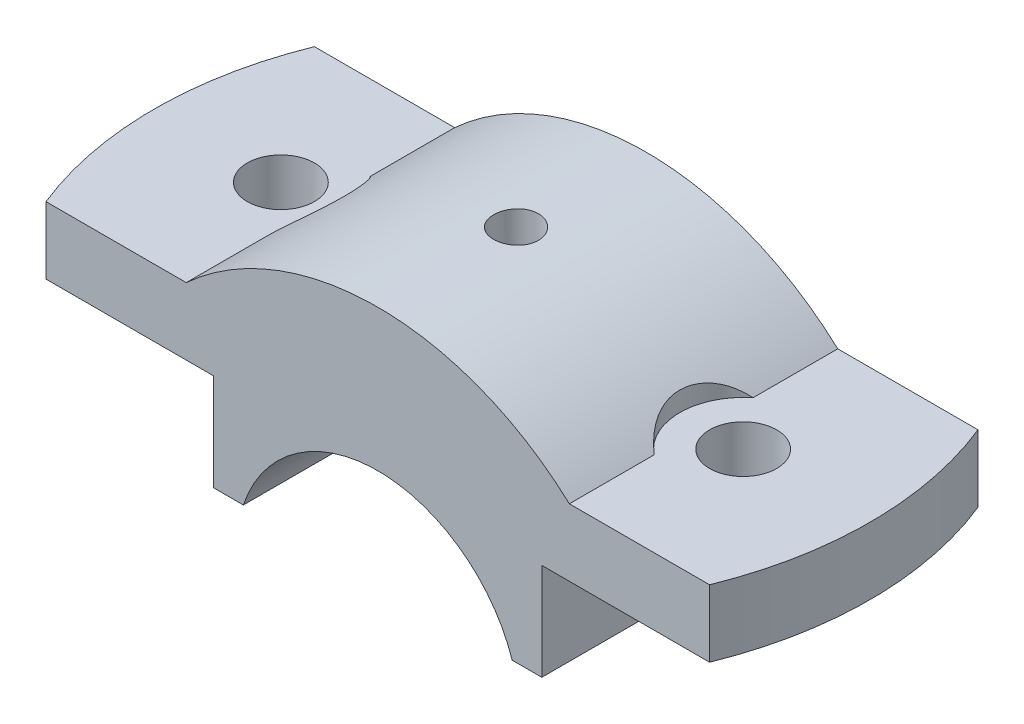
ISO-10303-21;
HEADER;
FILE_DESCRIPTION(('STEP AP214'),'2;1');
FILE_NAME('part.step','',(''),(''),'','','');
FILE_SCHEMA(('AUTOMOTIVE_DESIGN { 1 0 10303 214 1 1 1 1 }'));
ENDSEC;
DATA;
#1=APPLICATION_CONTEXT('core data for automotive mechanical design processes');
#2=APPLICATION_PROTOCOL_DEFINITION('international standard','automotive_design',2000,#1);
#3=PRODUCT_CONTEXT('',#1,'mechanical');
#4=PRODUCT('Part','Part','',(#3));
#5=PRODUCT_RELATED_PRODUCT_CATEGORY('part','',(#4));
#6=PRODUCT_DEFINITION_FORMATION('','',#4);
#7=PRODUCT_DEFINITION_CONTEXT('part definition',#1,'design');
#8=PRODUCT_DEFINITION('design','',#6,#7);
#9=PRODUCT_DEFINITION_SHAPE('','',#8);
#10=(LENGTH_UNIT() NAMED_UNIT(*) SI_UNIT(.MILLI.,.METRE.));
#11=(NAMED_UNIT(*) PLANE_ANGLE_UNIT() SI_UNIT($,.RADIAN.));
#12=(NAMED_UNIT(*) SI_UNIT($,.STERADIAN.) SOLID_ANGLE_UNIT());
#13=UNCERTAINTY_MEASURE_WITH_UNIT(LENGTH_MEASURE(1.E-05),#10,'distance_accuracy_value','');
#14=(GEOMETRIC_REPRESENTATION_CONTEXT(3) GLOBAL_UNCERTAINTY_ASSIGNED_CONTEXT((#13)) GLOBAL_UNIT_ASSIGNED_CONTEXT((#10,
#11,#12)) REPRESENTATION_CONTEXT('',''));
#15=CARTESIAN_POINT('',(0.,0.,0.));
#16=DIRECTION('',(0.,0.,1.));
#17=DIRECTION('',(1.,0.,0.));
#18=AXIS2_PLACEMENT_3D('',#15,#16,#17);
#19=CARTESIAN_POINT('',(0.,0.,18.));
#20=DIRECTION('',(0.,0.,-1.));
#21=DIRECTION('',(-1.,0.,0.));
#22=AXIS2_PLACEMENT_3D('',#19,#20,#21);
#23=CYLINDRICAL_SURFACE('',#22,38.);
#24=CARTESIAN_POINT('',(-3.08982391332671,37.8741731023218,-0.630795288447839));
#25=CARTESIAN_POINT('',(-3.0898165549349,37.8741746948604,-0.799024644671561));
#26=CARTESIAN_POINT('',(-3.07562848786559,37.8753394773225,-0.967369294693333));
#27=CARTESIAN_POINT('',(-3.01923698720128,37.8798756239767,-1.29940293840573));
#28=CARTESIAN_POINT('',(-2.9770016072084,37.8832495043098,-1.4630864009474));
#29=CARTESIAN_POINT('',(-2.86574196598837,37.8918278467397,-1.78094051220534));
#30=CARTESIAN_POINT('',(-2.79673264680653,37.8970312876407,-1.93511641139608));
#31=CARTESIAN_POINT('',(-2.63390908132286,37.9086949501464,-2.22965689013771));
#32=CARTESIAN_POINT('',(-2.54010022608505,37.915154898524,-2.37002446233251));
#33=CARTESIAN_POINT('',(-2.33010374224959,37.9286392656587,-2.63332666071541));
#34=CARTESIAN_POINT('',(-2.21387055398773,37.9356648163257,-2.75622489608433));
#35=CARTESIAN_POINT('',(-1.96241948714482,37.9495023872523,-2.98078737858625));
#36=CARTESIAN_POINT('',(-1.82720078847415,37.9563143982724,-3.08245070799361));
#37=CARTESIAN_POINT('',(-1.54140078703351,37.9689944478478,-3.26177697455488));
#38=CARTESIAN_POINT('',(-1.39079982088825,37.9748612528187,-3.33940866787183));
#39=CARTESIAN_POINT('',(-1.07864646467251,37.9850086460247,-3.46826811193882));
#40=CARTESIAN_POINT('',(-0.917094248856666,37.9892892594921,-3.51949628270621));
#41=CARTESIAN_POINT('',(-0.587983711464288,37.9958062560962,-3.59399041560165));
#42=CARTESIAN_POINT('',(-0.420438730280915,37.9980469178238,-3.61731493523321));
#43=CARTESIAN_POINT('',(-0.0837971765125405,38.0002803410745,-3.63552064771574));
#44=CARTESIAN_POINT('',(0.0852993698284713,38.0002731405494,-3.63040232078181));
#45=CARTESIAN_POINT('',(0.41984698390396,37.9980480728716,-3.5919156109289));
#46=CARTESIAN_POINT('',(0.58530533501741,37.9958351316131,-3.55861020084958));
#47=CARTESIAN_POINT('',(0.908280540162136,37.989487143397,-3.46479261549806));
#48=CARTESIAN_POINT('',(1.06579732521737,37.9853520797481,-3.40428020396619));
#49=CARTESIAN_POINT('',(1.36861800375843,37.9756485856812,-3.25769589218342));
#50=CARTESIAN_POINT('',(1.51390815434907,37.9700785701701,-3.17159571061819));
#51=CARTESIAN_POINT('',(1.78800007914447,37.9581599319298,-2.97630046711486));
#52=CARTESIAN_POINT('',(1.91680155366121,37.951811295053,-2.86710498550645));
#53=CARTESIAN_POINT('',(2.15462669298641,37.9390542443548,-2.6283637081708));
#54=CARTESIAN_POINT('',(2.26359544342305,37.9326457147059,-2.498763207519));
#55=CARTESIAN_POINT('',(2.45823648239351,37.9205302457739,-2.22308165416719));
#56=CARTESIAN_POINT('',(2.54390875445572,37.9148233069868,-2.07700058981482));
#57=CARTESIAN_POINT('',(2.68952121402615,37.9047731755244,-1.77246690905523));
#58=CARTESIAN_POINT('',(2.74945867716398,37.9004301272481,-1.61401298491442));
#59=CARTESIAN_POINT('',(2.84185919381097,37.8936142595588,-1.28924934107418));
#60=CARTESIAN_POINT('',(2.87432276501292,37.8911414049057,-1.12293976946172));
#61=CARTESIAN_POINT('',(2.91078419039268,37.8883580489696,-0.787665918035848));
#62=CARTESIAN_POINT('',(2.91485858020305,37.8880417338273,-0.618710007640313));
#63=CARTESIAN_POINT('',(2.89462628446873,37.8895927347694,-0.282517613968381));
#64=CARTESIAN_POINT('',(2.87031983612993,37.8914600326031,-0.115281116332986));
#65=CARTESIAN_POINT('',(2.79407997241663,37.8971576804359,0.21250631480709));
#66=CARTESIAN_POINT('',(2.74218216417818,37.9009855001142,0.373065578105344));
#67=CARTESIAN_POINT('',(2.61226972311129,37.9101604153929,0.6831986683295));
#68=CARTESIAN_POINT('',(2.5342547135451,37.9155075329088,0.832772336751453));
#69=CARTESIAN_POINT('',(2.35412942050933,37.9271170291635,1.11703887292779));
#70=CARTESIAN_POINT('',(2.25196807394453,37.9333813366839,1.25169930451709));
#71=CARTESIAN_POINT('',(2.02652528270787,37.9460921368276,1.50198927790213));
#72=CARTESIAN_POINT('',(1.90324351148431,37.9525386322665,1.61761852539456));
#73=CARTESIAN_POINT('',(1.63873032866563,37.9648797989003,1.82682440135379));
#74=CARTESIAN_POINT('',(1.49745956493949,37.9707732095547,1.92035135852804));
#75=CARTESIAN_POINT('',(1.2011763450818,37.9812996011018,2.08235717443185));
#76=CARTESIAN_POINT('',(1.04616401413792,37.9859325934756,2.15083626132201));
#77=CARTESIAN_POINT('',(0.726977968042412,37.9933801672545,2.26071690305636));
#78=CARTESIAN_POINT('',(0.562814935289909,37.9961968226505,2.30214934187949));
#79=CARTESIAN_POINT('',(0.229841049917166,37.9996694892143,2.3568615429918));
#80=CARTESIAN_POINT('',(0.0610302754096729,38.0003255366723,2.37014177813165));
#81=CARTESIAN_POINT('',(-0.275956903633853,37.9993705597177,2.36816732329972));
#82=CARTESIAN_POINT('',(-0.444133785054564,37.9977656942706,2.35299011717325));
#83=CARTESIAN_POINT('',(-0.775537341735708,37.9924468488176,2.29469297141069));
#84=CARTESIAN_POINT('',(-0.938764009731895,37.9887328657167,2.25157299077175));
#85=CARTESIAN_POINT('',(-1.25564084464436,37.979580182114,2.13863354720402));
#86=CARTESIAN_POINT('',(-1.40929143016511,37.9741415570658,2.06881525230645));
#87=CARTESIAN_POINT('',(-1.70269937496293,37.9621179850119,1.90447022460788));
#88=CARTESIAN_POINT('',(-1.84245698656857,37.9555330588317,1.8099439406744));
#89=CARTESIAN_POINT('',(-2.10450907637211,37.9419073405654,1.59857576519335));
#90=CARTESIAN_POINT('',(-2.22675739166434,37.9348654120544,1.48167671525565));
#91=CARTESIAN_POINT('',(-2.44994534300262,37.921106347273,1.22898076132884));
#92=CARTESIAN_POINT('',(-2.55087979918542,37.9143892902604,1.09317927679401));
#93=CARTESIAN_POINT('',(-2.7286979905416,37.9020077388586,0.806295579668881));
#94=CARTESIAN_POINT('',(-2.80553999682271,37.8963450775286,0.655187447702439));
#95=CARTESIAN_POINT('',(-2.93266787818905,37.8867201186517,0.342273058920388));
#96=CARTESIAN_POINT('',(-2.98298441896539,37.8827558586067,0.180479400172582));
#97=CARTESIAN_POINT('',(-3.04275704375659,37.8779902383086,-0.0903636252608886));
#98=CARTESIAN_POINT('',(-3.06038381900845,37.8765652133177,-0.197668879532321));
#99=CARTESIAN_POINT('',(-3.08391961588142,37.8746561322229,-0.413565160334391));
#100=CARTESIAN_POINT('',(-3.08982866522683,37.8741720738926,-0.522156183822268));
#101=CARTESIAN_POINT('',(-3.08982391332671,37.8741731023218,-0.630795288447839));
#102=B_SPLINE_CURVE_WITH_KNOTS('',3,(#24,#25,#26,#27,#28,#29,#30,#31,#32,#33,#34,#35,#36,#37,
#38,#39,#40,#41,#42,#43,#44,#45,#46,#47,#48,#49,#50,#51,#52,#53,#54,#55,#56,#57,#58,#59,#60,#61,
#62,#63,#64,#65,#66,#67,#68,#69,#70,#71,#72,#73,#74,#75,#76,#77,#78,#79,#80,#81,#82,#83,#84,#85,
#86,#87,#88,#89,#90,#91,#92,#93,#94,#95,#96,#97,#98,#99,#100,#101),.UNSPECIFIED.,.T.,.F.,(4,2,2,
2,2,2,2,2,2,2,2,2,2,2,2,2,2,2,2,2,2,2,2,2,2,2,2,2,2,2,2,2,2,2,2,2,2,2,4),(0.,0.504291421669989,
1.00915822788302,1.51374368152856,2.01821953559138,2.52373134073237,3.02926498845646,
3.53545315301367,4.04163326507021,4.546749253583,5.05185671399058,5.55583868228782,
6.05982502713928,6.56437049631086,7.06892513448829,7.5748562462125,8.08078771565083,
8.58677273143866,9.09274821269729,9.59735908295555,10.1019657357268,10.6059227598395,
11.10988705379,11.6149267875576,12.1199743306602,12.6261463157288,13.1323136899712,
13.6379020669613,14.1434819519093,14.6476872439429,15.1518932758423,15.6560772516295,
16.1602520685946,16.6657325841807,17.1713358046312,17.6778099691558,18.1836973153047,
18.5093592531183,18.8350204204102),.UNSPECIFIED.);
#103=CARTESIAN_POINT('',(-3.08982391332671,37.8741731023218,-0.630795288447839));
#104=VERTEX_POINT('',#103);
#105=EDGE_CURVE('E11',#104,#104,#102,.T.);
#106=ORIENTED_EDGE('',*,*,#105,.T.);
#107=EDGE_LOOP('',(#106));
#108=FACE_BOUND('',#107,.T.);
#109=DIRECTION('',(0.,0.,-1.));
#110=VECTOR('',#109,1.);
#111=CARTESIAN_POINT('',(25.6904651573303,28.,18.));
#112=LINE('',#111,#110);
#113=CARTESIAN_POINT('',(25.6904651573303,28.,18.));
#114=VERTEX_POINT('',#113);
#115=CARTESIAN_POINT('',(25.6904651573303,28.,6.6376833123068));
#116=VERTEX_POINT('',#115);
#117=EDGE_CURVE('E149',#114,#116,#112,.T.);
#118=ORIENTED_EDGE('',*,*,#117,.T.);
#119=CARTESIAN_POINT('',(25.6904651573303,28.,6.6376833123068));
#120=CARTESIAN_POINT('',(25.5360851043424,28.1416681018721,6.51420867249737));
#121=CARTESIAN_POINT('',(25.3836215551735,28.2791823336498,6.38340380017068));
#122=CARTESIAN_POINT('',(25.0841053598261,28.5451833866574,6.10685950724571));
#123=CARTESIAN_POINT('',(24.9370580895264,28.6736613482156,5.96110576476094));
#124=CARTESIAN_POINT('',(24.6491941230388,28.9215085426632,5.65349144226201));
#125=CARTESIAN_POINT('',(24.508431723833,29.0408031542341,5.4915194235394));
#126=CARTESIAN_POINT('',(24.2363075607749,29.2682904084011,5.1526368783667));
#127=CARTESIAN_POINT('',(24.1049430857226,29.3764862568107,4.97573069263072));
#128=CARTESIAN_POINT('',(23.8528205053459,29.5815743674557,4.60631493821573));
#129=CARTESIAN_POINT('',(23.7321338833277,29.6783916917415,4.41371469093335));
#130=CARTESIAN_POINT('',(23.5043908446779,29.85908164754,4.01479632179465));
#131=CARTESIAN_POINT('',(23.3973358972541,29.942952883943,3.8084767249227));
#132=CARTESIAN_POINT('',(23.1992536300817,30.0966827286364,3.38422419101505));
#133=CARTESIAN_POINT('',(23.1081729651954,30.1665880882949,3.16633319991271));
#134=CARTESIAN_POINT('',(22.9434688496595,30.2920447623401,2.72008092153075));
#135=CARTESIAN_POINT('',(22.869842066784,30.347598816803,2.49172164276594));
#136=CARTESIAN_POINT('',(22.7499342032063,30.4375648556656,2.05682098381957));
#137=CARTESIAN_POINT('',(22.7013462567531,30.4737833576563,1.85128534823193));
#138=CARTESIAN_POINT('',(22.6194172898017,30.534645499234,1.43551725204116));
#139=CARTESIAN_POINT('',(22.5860747992536,30.5592902548309,1.22528524633892));
#140=CARTESIAN_POINT('',(22.5352129551669,30.5968164834569,0.80179959149854));
#141=CARTESIAN_POINT('',(22.5176992505084,30.6096937569973,0.588544891193934));
#142=CARTESIAN_POINT('',(22.4988301660851,30.6235658271181,0.160939560666245));
#143=CARTESIAN_POINT('',(22.4974739036633,30.624561272785,-0.0534110090511226));
#144=CARTESIAN_POINT('',(22.5103301119086,30.6151119876343,-0.46199747981814));
#145=CARTESIAN_POINT('',(22.5231488228924,30.6056914251709,-0.656303160135766));
#146=CARTESIAN_POINT('',(22.5619809221014,30.5770763766543,-1.0428625929884));
#147=CARTESIAN_POINT('',(22.5879939672906,30.5578821447042,-1.23511639873687));
#148=CARTESIAN_POINT('',(22.6528192304938,30.5098574663833,-1.61613906729808));
#149=CARTESIAN_POINT('',(22.6916259266854,30.4810311771979,-1.80490939654947));
#150=CARTESIAN_POINT('',(22.7814851533843,30.4139289484325,-2.17779604427593));
#151=CARTESIAN_POINT('',(22.8325379785097,30.3756527815061,-2.36191225066402));
#152=CARTESIAN_POINT('',(22.9463727274414,30.2897519777021,-2.72495933677602));
#153=CARTESIAN_POINT('',(23.0091940590921,30.2420959034169,-2.90387039063446));
#154=CARTESIAN_POINT('',(23.1456283742011,30.1378044455698,-3.25489148863349));
#155=CARTESIAN_POINT('',(23.2192449894415,30.0811660396201,-3.42699921914349));
#156=CARTESIAN_POINT('',(23.3763137314078,29.9592695660632,-3.76349373210636));
#157=CARTESIAN_POINT('',(23.4597660818508,29.8940113023904,-3.92788033882065));
#158=CARTESIAN_POINT('',(23.6355270453779,29.7552415450916,-4.24828704232642));
#159=CARTESIAN_POINT('',(23.7278387953854,29.6817271265587,-4.40430414494655));
#160=CARTESIAN_POINT('',(23.9282386479047,29.5204551498758,-4.71995510834891));
#161=CARTESIAN_POINT('',(24.0370002176616,29.432022004933,-4.87881602386905));
#162=CARTESIAN_POINT('',(24.2623844714665,29.2465042091278,-5.18563329619879));
#163=CARTESIAN_POINT('',(24.379010630913,29.1494157272481,-5.33358477081361));
#164=CARTESIAN_POINT('',(24.6187042069683,28.9472618083659,-5.61815393006346));
#165=CARTESIAN_POINT('',(24.7417672458198,28.8422017715012,-5.75477915839727));
#166=CARTESIAN_POINT('',(24.9931857635632,28.6246099475779,-6.016738259449));
#167=CARTESIAN_POINT('',(25.121541230047,28.5120781780363,-6.14207215863704));
#168=CARTESIAN_POINT('',(25.3239635142993,28.3320696328102,-6.32788833390874));
#169=CARTESIAN_POINT('',(25.3966039536003,28.2669811541268,-6.39227987552885));
#170=CARTESIAN_POINT('',(25.5428336292653,28.1349133065772,-6.5175597465675));
#171=CARTESIAN_POINT('',(25.6164208573994,28.0679376662269,-6.57845434819236));
#172=CARTESIAN_POINT('',(25.6904651573302,28.0000000000002,-6.63768331230706));
#173=B_SPLINE_CURVE_WITH_KNOTS('',3,(#119,#120,#121,#122,#123,#124,#125,#126,#127,#128,#129,
#130,#131,#132,#133,#134,#135,#136,#137,#138,#139,#140,#141,#142,#143,#144,#145,#146,#147,#148,
#149,#150,#151,#152,#153,#154,#155,#156,#157,#158,#159,#160,#161,#162,#163,#164,#165,#166,#167,
#168,#169,#170,#171,#172),.UNSPECIFIED.,.F.,.F.,(4,2,2,2,2,2,2,2,2,2,2,2,2,2,2,2,2,2,2,2,2,2,2,
2,2,2,4),(0.,0.72959240083407,1.45989044138352,2.19560470883999,2.93110586753775,
3.67120763552798,4.41138910352643,5.14904966030397,5.8865692722368,6.52855006409985,
7.17046893961489,7.81261680885221,8.45472959834446,9.03890309081733,9.62306139629815,
10.2069679046447,10.7908884620571,11.3768004587137,11.9629100238154,12.549032922753,
13.1353641263273,13.7703169673958,14.4055522594533,15.040361004022,15.6751682603777,
16.0257258218313,16.3756336015193),.UNSPECIFIED.);
#174=CARTESIAN_POINT('',(25.6904651573303,28.,-6.6376833123068));
#175=VERTEX_POINT('',#174);
#176=EDGE_CURVE('E140',#116,#175,#173,.T.);
#177=ORIENTED_EDGE('',*,*,#176,.T.);
#178=CARTESIAN_POINT('',(25.6904651573303,28.,-18.));
#179=VERTEX_POINT('',#178);
#180=EDGE_CURVE('E146',#175,#179,#112,.T.);
#181=ORIENTED_EDGE('',*,*,#180,.T.);
#182=CARTESIAN_POINT('',(0.,0.,-18.));
#183=DIRECTION('',(0.,0.,1.));
#184=DIRECTION('',(-1.,0.,0.));
#185=AXIS2_PLACEMENT_3D('',#182,#183,#184);
#186=CIRCLE('',#185,38.);
#187=CARTESIAN_POINT('',(-25.6904651573303,28.,-18.));
#188=VERTEX_POINT('',#187);
#189=EDGE_CURVE('E338',#179,#188,#186,.T.);
#190=ORIENTED_EDGE('',*,*,#189,.T.);
#191=DIRECTION('',(0.,0.,-1.));
#192=VECTOR('',#191,1.);
#193=CARTESIAN_POINT('',(-25.6904651573303,28.,18.));
#194=LINE('',#193,#192);
#195=CARTESIAN_POINT('',(-25.6904651573303,28.,-6.63768331230679));
#196=VERTEX_POINT('',#195);
#197=EDGE_CURVE('E159',#196,#188,#194,.T.);
#198=ORIENTED_EDGE('',*,*,#197,.F.);
#199=CARTESIAN_POINT('',(-25.6904651573303,28.,6.6376833123068));
#200=CARTESIAN_POINT('',(-25.5360851043424,28.1416681018721,6.51420867249737));
#201=CARTESIAN_POINT('',(-25.3836215551735,28.2791823336498,6.38340380017068));
#202=CARTESIAN_POINT('',(-25.0841053598261,28.5451833866574,6.10685950724571));
#203=CARTESIAN_POINT('',(-24.9370580895264,28.6736613482156,5.96110576476094));
#204=CARTESIAN_POINT('',(-24.6491941230388,28.9215085426632,5.65349144226201));
#205=CARTESIAN_POINT('',(-24.508431723833,29.0408031542341,5.4915194235394));
#206=CARTESIAN_POINT('',(-24.2363075607749,29.2682904084011,5.1526368783667));
#207=CARTESIAN_POINT('',(-24.1049430857226,29.3764862568107,4.97573069263072));
#208=CARTESIAN_POINT('',(-23.8528205053459,29.5815743674557,4.60631493821573));
#209=CARTESIAN_POINT('',(-23.7321338833277,29.6783916917415,4.41371469093335));
#210=CARTESIAN_POINT('',(-23.5043908446779,29.85908164754,4.01479632179465));
#211=CARTESIAN_POINT('',(-23.3973358972541,29.942952883943,3.8084767249227));
#212=CARTESIAN_POINT('',(-23.1992536300817,30.0966827286364,3.38422419101505));
#213=CARTESIAN_POINT('',(-23.1081729651955,30.1665880882949,3.16633319991271));
#214=CARTESIAN_POINT('',(-22.9434688496595,30.2920447623401,2.72008092153075));
#215=CARTESIAN_POINT('',(-22.869842066784,30.347598816803,2.49172164276594));
#216=CARTESIAN_POINT('',(-22.7499342032063,30.4375648556656,2.05682098381957));
#217=CARTESIAN_POINT('',(-22.7013462567531,30.4737833576563,1.85128534823193));
#218=CARTESIAN_POINT('',(-22.6194172898017,30.534645499234,1.43551725204116));
#219=CARTESIAN_POINT('',(-22.5860747992536,30.5592902548309,1.22528524633892));
#220=CARTESIAN_POINT('',(-22.5352129551669,30.5968164834569,0.801799591498541));
#221=CARTESIAN_POINT('',(-22.5176992505084,30.6096937569973,0.588544891193935));
#222=CARTESIAN_POINT('',(-22.4988301660851,30.6235658271181,0.160939560666247));
#223=CARTESIAN_POINT('',(-22.4974739036633,30.624561272785,-0.0534110090511205));
#224=CARTESIAN_POINT('',(-22.5103301119086,30.6151119876343,-0.461997479818137));
#225=CARTESIAN_POINT('',(-22.5231488228924,30.6056914251709,-0.656303160135764));
#226=CARTESIAN_POINT('',(-22.5619809221014,30.5770763766543,-1.0428625929884));
#227=CARTESIAN_POINT('',(-22.5879939672906,30.5578821447042,-1.23511639873687));
#228=CARTESIAN_POINT('',(-22.6528192304938,30.5098574663833,-1.61613906729808));
#229=CARTESIAN_POINT('',(-22.6916259266854,30.4810311771979,-1.80490939654947));
#230=CARTESIAN_POINT('',(-22.7814851533843,30.4139289484325,-2.17779604427593));
#231=CARTESIAN_POINT('',(-22.8325379785097,30.3756527815061,-2.36191225066402));
#232=CARTESIAN_POINT('',(-22.9463727274414,30.2897519777021,-2.72495933677602));
#233=CARTESIAN_POINT('',(-23.0091940590921,30.2420959034169,-2.90387039063446));
#234=CARTESIAN_POINT('',(-23.1456283742011,30.1378044455698,-3.25489148863349));
#235=CARTESIAN_POINT('',(-23.2192449894415,30.0811660396201,-3.42699921914349));
#236=CARTESIAN_POINT('',(-23.3763137314078,29.9592695660632,-3.76349373210636));
#237=CARTESIAN_POINT('',(-23.4597660818508,29.8940113023904,-3.92788033882065));
#238=CARTESIAN_POINT('',(-23.6355270453779,29.7552415450916,-4.24828704232642));
#239=CARTESIAN_POINT('',(-23.7278387953854,29.6817271265587,-4.40430414494655));
#240=CARTESIAN_POINT('',(-23.9282386479047,29.5204551498758,-4.71995510834891));
#241=CARTESIAN_POINT('',(-24.0370002176616,29.432022004933,-4.87881602386905));
#242=CARTESIAN_POINT('',(-24.2623844714665,29.2465042091278,-5.18563329619879));
#243=CARTESIAN_POINT('',(-24.379010630913,29.1494157272481,-5.33358477081361));
#244=CARTESIAN_POINT('',(-24.6187042069683,28.9472618083659,-5.61815393006346));
#245=CARTESIAN_POINT('',(-24.7417672458198,28.8422017715012,-5.75477915839727));
#246=CARTESIAN_POINT('',(-24.9931857635632,28.6246099475779,-6.016738259449));
#247=CARTESIAN_POINT('',(-25.121541230047,28.5120781780363,-6.14207215863704));
#248=CARTESIAN_POINT('',(-25.3239635142993,28.3320696328102,-6.32788833390874));
#249=CARTESIAN_POINT('',(-25.3966039536003,28.2669811541268,-6.39227987552885));
#250=CARTESIAN_POINT('',(-25.5428336292653,28.1349133065772,-6.5175597465675));
#251=CARTESIAN_POINT('',(-25.6164208573994,28.0679376662269,-6.57845434819236));
#252=CARTESIAN_POINT('',(-25.6904651573302,28.0000000000002,-6.63768331230706));
#253=B_SPLINE_CURVE_WITH_KNOTS('',3,(#199,#200,#201,#202,#203,#204,#205,#206,#207,#208,#209,
#210,#211,#212,#213,#214,#215,#216,#217,#218,#219,#220,#221,#222,#223,#224,#225,#226,#227,#228,
#229,#230,#231,#232,#233,#234,#235,#236,#237,#238,#239,#240,#241,#242,#243,#244,#245,#246,#247,
#248,#249,#250,#251,#252),.UNSPECIFIED.,.F.,.F.,(4,2,2,2,2,2,2,2,2,2,2,2,2,2,2,2,2,2,2,2,2,2,2,
2,2,2,4),(0.,0.729592400834068,1.45989044138351,2.19560470883998,2.93110586753775,
3.67120763552798,4.41138910352642,5.14904966030396,5.88656927223679,6.52855006409984,
7.17046893961489,7.8126168088522,8.45472959834446,9.03890309081732,9.62306139629814,
10.2069679046447,10.7908884620571,11.3768004587137,11.9629100238154,12.549032922753,
13.1353641263273,13.7703169673958,14.4055522594533,15.040361004022,15.6751682603777,
16.0257258218313,16.3756336015193),.UNSPECIFIED.);
#254=CARTESIAN_POINT('',(-25.6904651573303,28.,6.6376833123068));
#255=VERTEX_POINT('',#254);
#256=EDGE_CURVE('E46',#255,#196,#253,.T.);
#257=ORIENTED_EDGE('',*,*,#256,.F.);
#258=CARTESIAN_POINT('',(-25.6904651573303,28.,18.));
#259=VERTEX_POINT('',#258);
#260=EDGE_CURVE('E156',#259,#255,#194,.T.);
#261=ORIENTED_EDGE('',*,*,#260,.F.);
#262=CARTESIAN_POINT('',(0.,0.,18.));
#263=DIRECTION('',(0.,0.,1.));
#264=DIRECTION('',(-1.,0.,0.));
#265=AXIS2_PLACEMENT_3D('',#262,#263,#264);
#266=CIRCLE('',#265,38.);
#267=EDGE_CURVE('E316',#114,#259,#266,.T.);
#268=ORIENTED_EDGE('',*,*,#267,.F.);
#269=EDGE_LOOP('',(#118,#177,#181,#190,#198,#257,#261,#268));
#270=FACE_BOUND('',#269,.T.);
#271=ADVANCED_FACE('F33',(#108,#270),#23,.T.);
#272=CARTESIAN_POINT('',(0.,0.,18.));
#273=DIRECTION('',(0.,0.,-1.));
#274=DIRECTION('',(-1.,0.,0.));
#275=AXIS2_PLACEMENT_3D('',#272,#273,#274);
#276=PLANE('',#275);
#277=DIRECTION('',(0.,1.,0.));
#278=VECTOR('',#277,1.);
#279=CARTESIAN_POINT('',(44.497190922574,-7.00000000000001,18.));
#280=LINE('',#279,#278);
#281=CARTESIAN_POINT('',(44.497190922574,19.,18.));
#282=VERTEX_POINT('',#281);
#283=CARTESIAN_POINT('',(44.497190922574,28.,18.));
#284=VERTEX_POINT('',#283);
#285=EDGE_CURVE('E282',#282,#284,#280,.T.);
#286=ORIENTED_EDGE('',*,*,#285,.T.);
#287=DIRECTION('',(-1.,0.,0.));
#288=VECTOR('',#287,1.);
#289=CARTESIAN_POINT('',(50.,28.,18.));
#290=LINE('',#289,#288);
#291=EDGE_CURVE('E314',#284,#114,#290,.T.);
#292=ORIENTED_EDGE('',*,*,#291,.T.);
#293=ORIENTED_EDGE('',*,*,#267,.T.);
#294=DIRECTION('',(-1.,0.,0.));
#295=VECTOR('',#294,1.);
#296=CARTESIAN_POINT('',(-50.,28.,18.));
#297=LINE('',#296,#295);
#298=CARTESIAN_POINT('',(-44.497190922574,28.,18.));
#299=VERTEX_POINT('',#298);
#300=EDGE_CURVE('E318',#259,#299,#297,.T.);
#301=ORIENTED_EDGE('',*,*,#300,.T.);
#302=DIRECTION('',(0.,1.,0.));
#303=VECTOR('',#302,1.);
#304=CARTESIAN_POINT('',(-44.497190922574,-7.00000000000001,18.));
#305=LINE('',#304,#303);
#306=CARTESIAN_POINT('',(-44.497190922574,19.,18.));
#307=VERTEX_POINT('',#306);
#308=EDGE_CURVE('E292',#307,#299,#305,.T.);
#309=ORIENTED_EDGE('',*,*,#308,.F.);
#310=DIRECTION('',(1.,0.,0.));
#311=VECTOR('',#310,1.);
#312=CARTESIAN_POINT('',(-22.,19.,18.));
#313=LINE('',#312,#311);
#314=CARTESIAN_POINT('',(-22.,19.,18.));
#315=VERTEX_POINT('',#314);
#316=EDGE_CURVE('E321',#307,#315,#313,.T.);
#317=ORIENTED_EDGE('',*,*,#316,.T.);
#318=DIRECTION('',(0.,-1.,0.));
#319=VECTOR('',#318,1.);
#320=CARTESIAN_POINT('',(-22.,6.,18.));
#321=LINE('',#320,#319);
#322=CARTESIAN_POINT('',(-22.,6.,18.));
#323=VERTEX_POINT('',#322);
#324=EDGE_CURVE('E323',#315,#323,#321,.T.);
#325=ORIENTED_EDGE('',*,*,#324,.T.);
#326=DIRECTION('',(1.,0.,0.));
#327=VECTOR('',#326,1.);
#328=CARTESIAN_POINT('',(-18.0277563773199,6.,18.));
#329=LINE('',#328,#327);
#330=CARTESIAN_POINT('',(-18.0277563773199,6.,18.));
#331=VERTEX_POINT('',#330);
#332=EDGE_CURVE('E325',#323,#331,#329,.T.);
#333=ORIENTED_EDGE('',*,*,#332,.T.);
#334=CARTESIAN_POINT('',(0.,0.,18.));
#335=DIRECTION('',(0.,0.,-1.));
#336=DIRECTION('',(-1.,0.,0.));
#337=AXIS2_PLACEMENT_3D('',#334,#335,#336);
#338=CIRCLE('',#337,19.);
#339=CARTESIAN_POINT('',(18.0277563773199,6.,18.));
#340=VERTEX_POINT('',#339);
#341=EDGE_CURVE('E303',#331,#340,#338,.T.);
#342=ORIENTED_EDGE('',*,*,#341,.T.);
#343=DIRECTION('',(1.,0.,0.));
#344=VECTOR('',#343,1.);
#345=CARTESIAN_POINT('',(18.0277563773199,6.,18.));
#346=LINE('',#345,#344);
#347=CARTESIAN_POINT('',(22.,6.,18.));
#348=VERTEX_POINT('',#347);
#349=EDGE_CURVE('E306',#340,#348,#346,.T.);
#350=ORIENTED_EDGE('',*,*,#349,.T.);
#351=DIRECTION('',(0.,1.,0.));
#352=VECTOR('',#351,1.);
#353=CARTESIAN_POINT('',(22.,6.,18.));
#354=LINE('',#353,#352);
#355=CARTESIAN_POINT('',(22.,19.,18.));
#356=VERTEX_POINT('',#355);
#357=EDGE_CURVE('E309',#348,#356,#354,.T.);
#358=ORIENTED_EDGE('',*,*,#357,.T.);
#359=DIRECTION('',(1.,0.,0.));
#360=VECTOR('',#359,1.);
#361=CARTESIAN_POINT('',(22.,19.,18.));
#362=LINE('',#361,#360);
#363=EDGE_CURVE('E311',#356,#282,#362,.T.);
#364=ORIENTED_EDGE('',*,*,#363,.T.);
#365=EDGE_LOOP('',(#286,#292,#293,#301,#309,#317,#325,#333,#342,#350,#358,#364));
#366=FACE_BOUND('',#365,.T.);
#367=ADVANCED_FACE('F206',(#366),#276,.F.);
#368=CARTESIAN_POINT('',(0.,0.,-18.));
#369=DIRECTION('',(0.,0.,-1.));
#370=DIRECTION('',(-1.,0.,0.));
#371=AXIS2_PLACEMENT_3D('',#368,#369,#370);
#372=PLANE('',#371);
#373=DIRECTION('',(-1.,0.,0.));
#374=VECTOR('',#373,1.);
#375=CARTESIAN_POINT('',(50.,28.,-18.));
#376=LINE('',#375,#374);
#377=CARTESIAN_POINT('',(44.497190922574,28.,-18.));
#378=VERTEX_POINT('',#377);
#379=EDGE_CURVE('E154',#378,#179,#376,.T.);
#380=ORIENTED_EDGE('',*,*,#379,.F.);
#381=DIRECTION('',(0.,1.,0.));
#382=VECTOR('',#381,1.);
#383=CARTESIAN_POINT('',(44.497190922574,-7.00000000000001,-18.));
#384=LINE('',#383,#382);
#385=CARTESIAN_POINT('',(44.497190922574,19.,-18.));
#386=VERTEX_POINT('',#385);
#387=EDGE_CURVE('E283',#386,#378,#384,.T.);
#388=ORIENTED_EDGE('',*,*,#387,.F.);
#389=DIRECTION('',(1.,0.,0.));
#390=VECTOR('',#389,1.);
#391=CARTESIAN_POINT('',(22.,19.,-18.));
#392=LINE('',#391,#390);
#393=CARTESIAN_POINT('',(22.,19.,-18.));
#394=VERTEX_POINT('',#393);
#395=EDGE_CURVE('E334',#394,#386,#392,.T.);
#396=ORIENTED_EDGE('',*,*,#395,.F.);
#397=DIRECTION('',(0.,1.,0.));
#398=VECTOR('',#397,1.);
#399=CARTESIAN_POINT('',(22.,6.,-18.));
#400=LINE('',#399,#398);
#401=CARTESIAN_POINT('',(22.,6.,-18.));
#402=VERTEX_POINT('',#401);
#403=EDGE_CURVE('E332',#402,#394,#400,.T.);
#404=ORIENTED_EDGE('',*,*,#403,.F.);
#405=DIRECTION('',(1.,0.,0.));
#406=VECTOR('',#405,1.);
#407=CARTESIAN_POINT('',(18.0277563773199,6.,-18.));
#408=LINE('',#407,#406);
#409=CARTESIAN_POINT('',(18.0277563773199,6.,-18.));
#410=VERTEX_POINT('',#409);
#411=EDGE_CURVE('E330',#410,#402,#408,.T.);
#412=ORIENTED_EDGE('',*,*,#411,.F.);
#413=CARTESIAN_POINT('',(0.,0.,-18.));
#414=DIRECTION('',(0.,0.,-1.));
#415=DIRECTION('',(-1.,0.,0.));
#416=AXIS2_PLACEMENT_3D('',#413,#414,#415);
#417=CIRCLE('',#416,19.);
#418=CARTESIAN_POINT('',(-18.0277563773199,6.,-18.));
#419=VERTEX_POINT('',#418);
#420=EDGE_CURVE('E302',#419,#410,#417,.T.);
#421=ORIENTED_EDGE('',*,*,#420,.F.);
#422=DIRECTION('',(1.,0.,0.));
#423=VECTOR('',#422,1.);
#424=CARTESIAN_POINT('',(-18.0277563773199,6.,-18.));
#425=LINE('',#424,#423);
#426=CARTESIAN_POINT('',(-22.,6.,-18.));
#427=VERTEX_POINT('',#426);
#428=EDGE_CURVE('E307',#427,#419,#425,.T.);
#429=ORIENTED_EDGE('',*,*,#428,.F.);
#430=DIRECTION('',(0.,-1.,0.));
#431=VECTOR('',#430,1.);
#432=CARTESIAN_POINT('',(-22.,6.,-18.));
#433=LINE('',#432,#431);
#434=CARTESIAN_POINT('',(-22.,19.,-18.));
#435=VERTEX_POINT('',#434);
#436=EDGE_CURVE('E345',#435,#427,#433,.T.);
#437=ORIENTED_EDGE('',*,*,#436,.F.);
#438=DIRECTION('',(1.,0.,0.));
#439=VECTOR('',#438,1.);
#440=CARTESIAN_POINT('',(-22.,19.,-18.));
#441=LINE('',#440,#439);
#442=CARTESIAN_POINT('',(-44.497190922574,19.,-18.));
#443=VERTEX_POINT('',#442);
#444=EDGE_CURVE('E343',#443,#435,#441,.T.);
#445=ORIENTED_EDGE('',*,*,#444,.F.);
#446=DIRECTION('',(0.,1.,0.));
#447=VECTOR('',#446,1.);
#448=CARTESIAN_POINT('',(-44.497190922574,-7.00000000000001,-18.));
#449=LINE('',#448,#447);
#450=CARTESIAN_POINT('',(-44.497190922574,28.,-18.));
#451=VERTEX_POINT('',#450);
#452=EDGE_CURVE('E171',#443,#451,#449,.T.);
#453=ORIENTED_EDGE('',*,*,#452,.T.);
#454=DIRECTION('',(-1.,0.,0.));
#455=VECTOR('',#454,1.);
#456=CARTESIAN_POINT('',(-50.,28.,-18.));
#457=LINE('',#456,#455);
#458=EDGE_CURVE('E340',#188,#451,#457,.T.);
#459=ORIENTED_EDGE('',*,*,#458,.F.);
#460=ORIENTED_EDGE('',*,*,#189,.F.);
#461=EDGE_LOOP('',(#380,#388,#396,#404,#412,#421,#429,#437,#445,#453,#459,#460));
#462=FACE_BOUND('',#461,.T.);
#463=ADVANCED_FACE('F209',(#462),#372,.T.);
#464=CARTESIAN_POINT('',(22.,19.,18.));
#465=DIRECTION('',(0.,1.,0.));
#466=DIRECTION('',(-1.,0.,0.));
#467=AXIS2_PLACEMENT_3D('',#464,#465,#466);
#468=PLANE('',#467);
#469=CARTESIAN_POINT('',(31.,19.,0.));
#470=DIRECTION('',(0.,1.,0.));
#471=DIRECTION('',(-1.,0.,0.));
#472=AXIS2_PLACEMENT_3D('',#469,#470,#471);
#473=CIRCLE('',#472,4.49999999999999);
#474=CARTESIAN_POINT('',(26.5,19.,0.));
#475=VERTEX_POINT('',#474);
#476=EDGE_CURVE('E142',#475,#475,#473,.T.);
#477=ORIENTED_EDGE('',*,*,#476,.T.);
#478=EDGE_LOOP('',(#477));
#479=FACE_BOUND('',#478,.T.);
#480=CARTESIAN_POINT('',(0.,19.,0.));
#481=DIRECTION('',(0.,1.,0.));
#482=DIRECTION('',(-1.,0.,0.));
#483=AXIS2_PLACEMENT_3D('',#480,#481,#482);
#484=CIRCLE('',#483,48.);
#485=EDGE_CURVE('E285',#282,#386,#484,.T.);
#486=ORIENTED_EDGE('',*,*,#485,.F.);
#487=ORIENTED_EDGE('',*,*,#363,.F.);
#488=DIRECTION('',(0.,0.,-1.));
#489=VECTOR('',#488,1.);
#490=CARTESIAN_POINT('',(22.,19.,18.));
#491=LINE('',#490,#489);
#492=EDGE_CURVE('E158',#356,#394,#491,.T.);
#493=ORIENTED_EDGE('',*,*,#492,.T.);
#494=ORIENTED_EDGE('',*,*,#395,.T.);
#495=EDGE_LOOP('',(#486,#487,#493,#494));
#496=FACE_BOUND('',#495,.T.);
#497=ADVANCED_FACE('F213',(#479,#496),#468,.F.);
#498=CARTESIAN_POINT('',(50.,28.,18.));
#499=DIRECTION('',(0.,-1.,0.));
#500=DIRECTION('',(0.,0.,-1.));
#501=AXIS2_PLACEMENT_3D('',#498,#499,#500);
#502=PLANE('',#501);
#503=CARTESIAN_POINT('',(31.,28.,0.));
#504=DIRECTION('',(0.,1.,0.));
#505=DIRECTION('',(0.,0.,1.));
#506=AXIS2_PLACEMENT_3D('',#503,#504,#505);
#507=CIRCLE('',#506,4.49999999999999);
#508=CARTESIAN_POINT('',(31.,28.,4.49999999999999));
#509=VERTEX_POINT('',#508);
#510=EDGE_CURVE('E268',#509,#509,#507,.T.);
#511=ORIENTED_EDGE('',*,*,#510,.F.);
#512=EDGE_LOOP('',(#511));
#513=FACE_BOUND('',#512,.T.);
#514=CARTESIAN_POINT('',(0.,28.,0.));
#515=DIRECTION('',(0.,1.,0.));
#516=DIRECTION('',(0.,0.,1.));
#517=AXIS2_PLACEMENT_3D('',#514,#515,#516);
#518=CIRCLE('',#517,48.);
#519=EDGE_CURVE('E280',#284,#378,#518,.T.);
#520=ORIENTED_EDGE('',*,*,#519,.T.);
#521=ORIENTED_EDGE('',*,*,#379,.T.);
#522=ORIENTED_EDGE('',*,*,#180,.F.);
#523=CARTESIAN_POINT('',(31.,28.,0.));
#524=DIRECTION('',(0.,-1.,0.));
#525=DIRECTION('',(0.,0.,-1.));
#526=AXIS2_PLACEMENT_3D('',#523,#524,#525);
#527=CIRCLE('',#526,8.5);
#528=EDGE_CURVE('E53',#116,#175,#527,.T.);
#529=ORIENTED_EDGE('',*,*,#528,.F.);
#530=ORIENTED_EDGE('',*,*,#117,.F.);
#531=ORIENTED_EDGE('',*,*,#291,.F.);
#532=EDGE_LOOP('',(#520,#521,#522,#529,#530,#531));
#533=FACE_BOUND('',#532,.T.);
#534=ADVANCED_FACE('F152',(#513,#533),#502,.F.);
#535=CARTESIAN_POINT('',(-50.,28.,18.));
#536=DIRECTION('',(0.,-1.,0.));
#537=DIRECTION('',(0.,0.,-1.));
#538=AXIS2_PLACEMENT_3D('',#535,#536,#537);
#539=PLANE('',#538);
#540=CARTESIAN_POINT('',(-31.,28.,0.));
#541=DIRECTION('',(0.,1.,0.));
#542=DIRECTION('',(0.,0.,1.));
#543=AXIS2_PLACEMENT_3D('',#540,#541,#542);
#544=CIRCLE('',#543,4.49999999999999);
#545=CARTESIAN_POINT('',(-31.,28.,4.49999999999999));
#546=VERTEX_POINT('',#545);
#547=EDGE_CURVE('E296',#546,#546,#544,.T.);
#548=ORIENTED_EDGE('',*,*,#547,.F.);
#549=EDGE_LOOP('',(#548));
#550=FACE_BOUND('',#549,.T.);
#551=CARTESIAN_POINT('',(0.,28.,0.));
#552=DIRECTION('',(0.,1.,0.));
#553=DIRECTION('',(0.,0.,1.));
#554=AXIS2_PLACEMENT_3D('',#551,#552,#553);
#555=CIRCLE('',#554,48.);
#556=EDGE_CURVE('E289',#451,#299,#555,.T.);
#557=ORIENTED_EDGE('',*,*,#556,.T.);
#558=ORIENTED_EDGE('',*,*,#300,.F.);
#559=ORIENTED_EDGE('',*,*,#260,.T.);
#560=CARTESIAN_POINT('',(-31.,28.,0.));
#561=DIRECTION('',(0.,1.,0.));
#562=DIRECTION('',(0.,0.,-1.));
#563=AXIS2_PLACEMENT_3D('',#560,#561,#562);
#564=CIRCLE('',#563,8.5);
#565=EDGE_CURVE('E61',#255,#196,#564,.T.);
#566=ORIENTED_EDGE('',*,*,#565,.T.);
#567=ORIENTED_EDGE('',*,*,#197,.T.);
#568=ORIENTED_EDGE('',*,*,#458,.T.);
#569=EDGE_LOOP('',(#557,#558,#559,#566,#567,#568));
#570=FACE_BOUND('',#569,.T.);
#571=ADVANCED_FACE('F225',(#550,#570),#539,.F.);
#572=CARTESIAN_POINT('',(-22.,19.,18.));
#573=DIRECTION('',(0.,1.,0.));
#574=DIRECTION('',(-1.,0.,0.));
#575=AXIS2_PLACEMENT_3D('',#572,#573,#574);
#576=PLANE('',#575);
#577=CARTESIAN_POINT('',(-31.,19.,0.));
#578=DIRECTION('',(0.,1.,0.));
#579=DIRECTION('',(-1.,0.,0.));
#580=AXIS2_PLACEMENT_3D('',#577,#578,#579);
#581=CIRCLE('',#580,4.49999999999999);
#582=CARTESIAN_POINT('',(-35.5,19.,0.));
#583=VERTEX_POINT('',#582);
#584=EDGE_CURVE('E299',#583,#583,#581,.T.);
#585=ORIENTED_EDGE('',*,*,#584,.T.);
#586=EDGE_LOOP('',(#585));
#587=FACE_BOUND('',#586,.T.);
#588=CARTESIAN_POINT('',(0.,19.,0.));
#589=DIRECTION('',(0.,1.,0.));
#590=DIRECTION('',(-1.,0.,0.));
#591=AXIS2_PLACEMENT_3D('',#588,#589,#590);
#592=CIRCLE('',#591,48.);
#593=EDGE_CURVE('E294',#443,#307,#592,.T.);
#594=ORIENTED_EDGE('',*,*,#593,.F.);
#595=ORIENTED_EDGE('',*,*,#444,.T.);
#596=DIRECTION('',(0.,0.,-1.));
#597=VECTOR('',#596,1.);
#598=CARTESIAN_POINT('',(-22.,19.,18.));
#599=LINE('',#598,#597);
#600=EDGE_CURVE('E352',#315,#435,#599,.T.);
#601=ORIENTED_EDGE('',*,*,#600,.F.);
#602=ORIENTED_EDGE('',*,*,#316,.F.);
#603=EDGE_LOOP('',(#594,#595,#601,#602));
#604=FACE_BOUND('',#603,.T.);
#605=ADVANCED_FACE('F223',(#587,#604),#576,.F.);
#606=CARTESIAN_POINT('',(0.,0.,18.));
#607=DIRECTION('',(0.,0.,-1.));
#608=DIRECTION('',(-1.,0.,0.));
#609=AXIS2_PLACEMENT_3D('',#606,#607,#608);
#610=CYLINDRICAL_SURFACE('',#609,19.);
#611=CARTESIAN_POINT('',(-2.54465803919703,18.8288267150014,-0.630795288447839));
#612=CARTESIAN_POINT('',(-2.54465213997579,18.8288288277131,-0.491022877740611));
#613=CARTESIAN_POINT('',(-2.53290043105066,18.8304272781397,-0.351164633530143));
#614=CARTESIAN_POINT('',(-2.48620853872131,18.8366478021612,-0.0753448388433947));
#615=CARTESIAN_POINT('',(-2.45124452091425,18.8412729835341,0.0606125563933888));
#616=CARTESIAN_POINT('',(-2.35917953643618,18.8530212850523,0.324597551850946));
#617=CARTESIAN_POINT('',(-2.30209407619965,18.8601426551149,0.452630634019936));
#618=CARTESIAN_POINT('',(-2.16743932777065,18.8760902141103,0.697274867147403));
#619=CARTESIAN_POINT('',(-2.08987337285287,18.8849161255601,0.813887872534669));
#620=CARTESIAN_POINT('',(-1.91594408120384,18.903354892224,1.03312571552157));
#621=CARTESIAN_POINT('',(-1.81947919504817,18.9129718282546,1.13566965631936));
#622=CARTESIAN_POINT('',(-1.61070720947643,18.9318933616545,1.3231591650152));
#623=CARTESIAN_POINT('',(-1.4983993025981,18.9411979430742,1.40810383539611));
#624=CARTESIAN_POINT('',(-1.26061643442861,18.9585096045134,1.55827596909746));
#625=CARTESIAN_POINT('',(-1.13509462914349,18.9665117936657,1.62342987083452));
#626=CARTESIAN_POINT('',(-0.874767233725773,18.9802990775773,1.73169960565749));
#627=CARTESIAN_POINT('',(-0.739962024109653,18.9860842631455,1.77481634141307));
#628=CARTESIAN_POINT('',(-0.465722372618827,18.9947836294805,1.83754515675618));
#629=CARTESIAN_POINT('',(-0.326319291024388,18.9977142565428,1.85729202331973));
#630=CARTESIAN_POINT('',(-0.0461481365081067,19.0004602787685,1.87313848048778));
#631=CARTESIAN_POINT('',(0.09461987698637,19.000275808956,1.86923909604475));
#632=CARTESIAN_POINT('',(0.372607202899258,18.9968517074041,1.83801135302345));
#633=CARTESIAN_POINT('',(0.509843072434689,18.9936309676894,1.81082796575007));
#634=CARTESIAN_POINT('',(0.777794455167121,18.9845468401034,1.73403070441981));
#635=CARTESIAN_POINT('',(0.908509833164856,18.9786833974622,1.68441636548238));
#636=CARTESIAN_POINT('',(1.16015488962266,18.9649672770455,1.56401282607249));
#637=CARTESIAN_POINT('',(1.28105442015442,18.9571087556624,1.4931613095843));
#638=CARTESIAN_POINT('',(1.50930528944835,18.9403039884878,1.33233999897254));
#639=CARTESIAN_POINT('',(1.6166559396466,18.9313576874598,1.24236923381799));
#640=CARTESIAN_POINT('',(1.81561255387816,18.9133187398387,1.04505245786742));
#641=CARTESIAN_POINT('',(1.90709314727518,18.9042254980567,0.937580043056361));
#642=CARTESIAN_POINT('',(2.07073530726962,18.8870020660571,0.708743759190303));
#643=CARTESIAN_POINT('',(2.1428968008961,18.8788718794772,0.587379837667604));
#644=CARTESIAN_POINT('',(2.26586024250794,18.8645098099367,0.334089257451141));
#645=CARTESIAN_POINT('',(2.31665144851345,18.8582788820894,0.202157326212765));
#646=CARTESIAN_POINT('',(2.39531638495495,18.848449418982,-0.0684630165977632));
#647=CARTESIAN_POINT('',(2.42319134379114,18.844850742624,-0.207151065593466));
#648=CARTESIAN_POINT('',(2.45506423636385,18.8407250449898,-0.486237517843002));
#649=CARTESIAN_POINT('',(2.4592389764007,18.8401752792118,-0.62661540577282));
#650=CARTESIAN_POINT('',(2.44405997177145,18.8421502788945,-0.906068401343544));
#651=CARTESIAN_POINT('',(2.42470678429031,18.8446749715463,-1.04514353975738));
#652=CARTESIAN_POINT('',(2.36317094763113,18.8524897352294,-1.31750913376852));
#653=CARTESIAN_POINT('',(2.32107451650851,18.8577693599384,-1.45081939537745));
#654=CARTESIAN_POINT('',(2.21533720480073,18.8704822390722,-1.70849187919498));
#655=CARTESIAN_POINT('',(2.15169549037336,18.8779155768481,-1.83285375485861));
#656=CARTESIAN_POINT('',(2.00424342004592,18.894139857271,-2.06989716792417));
#657=CARTESIAN_POINT('',(1.92031750233443,18.9029384713765,-2.18250628621753));
#658=CARTESIAN_POINT('',(1.73484389338034,18.9208608510265,-2.39210735070491));
#659=CARTESIAN_POINT('',(1.63329544097199,18.9299846306023,-2.48909862197215));
#660=CARTESIAN_POINT('',(1.41468737114169,18.9475786617065,-2.66533507707069));
#661=CARTESIAN_POINT('',(1.29753350843553,18.9560444038721,-2.74446387036392));
#662=CARTESIAN_POINT('',(1.05149836604933,18.9712814873634,-2.88192248724537));
#663=CARTESIAN_POINT('',(0.922617344402448,18.9780528659579,-2.94025276832527));
#664=CARTESIAN_POINT('',(0.657168781882743,18.9890944595601,-3.03426790176818));
#665=CARTESIAN_POINT('',(0.520625064999275,18.9933720019888,-3.07001912225732));
#666=CARTESIAN_POINT('',(0.243414992512186,18.9989462056797,-3.11807693999823));
#667=CARTESIAN_POINT('',(0.10274884430138,19.0002430166379,-3.13038471460281));
#668=CARTESIAN_POINT('',(-0.177578216293656,18.9996833207569,-3.13118261216217));
#669=CARTESIAN_POINT('',(-0.317238699896436,18.9978505475172,-3.11985185659807));
#670=CARTESIAN_POINT('',(-0.592644616420891,18.9912546321457,-3.07407482681978));
#671=CARTESIAN_POINT('',(-0.728390054204982,18.9864914936535,-3.0396285813159));
#672=CARTESIAN_POINT('',(-0.992083568685884,18.9745407697454,-2.94865647349147));
#673=CARTESIAN_POINT('',(-1.12003498552458,18.9673542316357,-2.89214014740147));
#674=CARTESIAN_POINT('',(-1.36466211472148,18.9513256020394,-2.75865078786206));
#675=CARTESIAN_POINT('',(-1.48133763472308,18.9424834823176,-2.68167740551775));
#676=CARTESIAN_POINT('',(-1.70101615933402,18.9240271208675,-2.50879967783027));
#677=CARTESIAN_POINT('',(-1.80391400969599,18.9144077503881,-2.4127622498016));
#678=CARTESIAN_POINT('',(-1.99220236281641,18.8955049776165,-2.20476058479586));
#679=CARTESIAN_POINT('',(-2.07758872497803,18.8862216552092,-2.09279259160769));
#680=CARTESIAN_POINT('',(-2.22874919496846,18.8689826745843,-1.85555433012148));
#681=CARTESIAN_POINT('',(-2.2944378281313,18.8610328667552,-1.73022919731816));
#682=CARTESIAN_POINT('',(-2.4037463050621,18.8474153350379,-1.4702877564072));
#683=CARTESIAN_POINT('',(-2.44738988234861,18.8417451582668,-1.3356816184149));
#684=CARTESIAN_POINT('',(-2.5010543809197,18.8346802475931,-1.10546615069674));
#685=CARTESIAN_POINT('',(-2.51738189440076,18.832496136022,-1.01130210139236));
#686=CARTESIAN_POINT('',(-2.53918569072792,18.8295686544816,-0.821703806288669));
#687=CARTESIAN_POINT('',(-2.54466206877566,18.8288252718723,-0.726269571640637));
#688=CARTESIAN_POINT('',(-2.54465803919703,18.8288267150014,-0.630795288447839));
#689=B_SPLINE_CURVE_WITH_KNOTS('',3,(#611,#612,#613,#614,#615,#616,#617,#618,#619,#620,#621,
#622,#623,#624,#625,#626,#627,#628,#629,#630,#631,#632,#633,#634,#635,#636,#637,#638,#639,#640,
#641,#642,#643,#644,#645,#646,#647,#648,#649,#650,#651,#652,#653,#654,#655,#656,#657,#658,#659,
#660,#661,#662,#663,#664,#665,#666,#667,#668,#669,#670,#671,#672,#673,#674,#675,#676,#677,#678,
#679,#680,#681,#682,#683,#684,#685,#686,#687,#688),.UNSPECIFIED.,.T.,.F.,(4,2,2,2,2,2,2,2,2,2,2,
2,2,2,2,2,2,2,2,2,2,2,2,2,2,2,2,2,2,2,2,2,2,2,2,2,2,2,4),(0.,0.418968405157234,
0.838367673884207,1.25747348717214,1.67651113147086,2.09786539850394,2.5192411482254,
2.94216449298394,3.36507051288868,3.78552532472134,4.20596191196856,4.62379964025608,
5.0416460286104,5.46073070560078,5.87983667220914,6.30211603448239,6.7243969917415,
7.14688995971333,7.56936027893769,7.98867473820329,8.40797926751845,8.82570528325037,
9.24344746759816,9.6636281369549,10.0838269595902,10.5066894380017,10.9295426144014,
11.3511470138381,11.7727302393306,12.1911305153045,12.6095302716104,13.0277494418252,
13.4459757452217,13.8672313515222,14.2885864492938,14.7117443270811,15.1344456605118,
15.4206327478507,15.7068173243377),.UNSPECIFIED.);
#690=CARTESIAN_POINT('',(-2.54465803919703,18.8288267150014,-0.630795288447839));
#691=VERTEX_POINT('',#690);
#692=EDGE_CURVE('E38',#691,#691,#689,.T.);
#693=ORIENTED_EDGE('',*,*,#692,.T.);
#694=EDGE_LOOP('',(#693));
#695=FACE_BOUND('',#694,.T.);
#696=ORIENTED_EDGE('',*,*,#420,.T.);
#697=DIRECTION('',(0.,0.,-1.));
#698=VECTOR('',#697,1.);
#699=CARTESIAN_POINT('',(18.0277563773199,6.,18.));
#700=LINE('',#699,#698);
#701=EDGE_CURVE('E168',#340,#410,#700,.T.);
#702=ORIENTED_EDGE('',*,*,#701,.F.);
#703=ORIENTED_EDGE('',*,*,#341,.F.);
#704=DIRECTION('',(0.,0.,-1.));
#705=VECTOR('',#704,1.);
#706=CARTESIAN_POINT('',(-18.0277563773199,6.,18.));
#707=LINE('',#706,#705);
#708=EDGE_CURVE('E327',#331,#419,#707,.T.);
#709=ORIENTED_EDGE('',*,*,#708,.T.);
#710=EDGE_LOOP('',(#696,#702,#703,#709));
#711=FACE_BOUND('',#710,.T.);
#712=ADVANCED_FACE('F35',(#695,#711),#610,.F.);
#713=CARTESIAN_POINT('',(18.0277563773199,6.,18.));
#714=DIRECTION('',(0.,1.,0.));
#715=DIRECTION('',(0.,0.,1.));
#716=AXIS2_PLACEMENT_3D('',#713,#714,#715);
#717=PLANE('',#716);
#718=ORIENTED_EDGE('',*,*,#411,.T.);
#719=DIRECTION('',(0.,0.,-1.));
#720=VECTOR('',#719,1.);
#721=CARTESIAN_POINT('',(22.,6.,18.));
#722=LINE('',#721,#720);
#723=EDGE_CURVE('E165',#348,#402,#722,.T.);
#724=ORIENTED_EDGE('',*,*,#723,.F.);
#725=ORIENTED_EDGE('',*,*,#349,.F.);
#726=ORIENTED_EDGE('',*,*,#701,.T.);
#727=EDGE_LOOP('',(#718,#724,#725,#726));
#728=FACE_BOUND('',#727,.T.);
#729=ADVANCED_FACE('F383',(#728),#717,.F.);
#730=CARTESIAN_POINT('',(22.,6.,18.));
#731=DIRECTION('',(-1.,0.,0.));
#732=DIRECTION('',(0.,-1.,0.));
#733=AXIS2_PLACEMENT_3D('',#730,#731,#732);
#734=PLANE('',#733);
#735=ORIENTED_EDGE('',*,*,#403,.T.);
#736=ORIENTED_EDGE('',*,*,#492,.F.);
#737=ORIENTED_EDGE('',*,*,#357,.F.);
#738=ORIENTED_EDGE('',*,*,#723,.T.);
#739=EDGE_LOOP('',(#735,#736,#737,#738));
#740=FACE_BOUND('',#739,.T.);
#741=ADVANCED_FACE('F221',(#740),#734,.F.);
#742=CARTESIAN_POINT('',(-22.,6.,18.));
#743=DIRECTION('',(1.,0.,0.));
#744=DIRECTION('',(0.,1.,0.));
#745=AXIS2_PLACEMENT_3D('',#742,#743,#744);
#746=PLANE('',#745);
#747=ORIENTED_EDGE('',*,*,#436,.T.);
#748=DIRECTION('',(0.,0.,-1.));
#749=VECTOR('',#748,1.);
#750=CARTESIAN_POINT('',(-22.,6.,18.));
#751=LINE('',#750,#749);
#752=EDGE_CURVE('E350',#323,#427,#751,.T.);
#753=ORIENTED_EDGE('',*,*,#752,.F.);
#754=ORIENTED_EDGE('',*,*,#324,.F.);
#755=ORIENTED_EDGE('',*,*,#600,.T.);
#756=EDGE_LOOP('',(#747,#753,#754,#755));
#757=FACE_BOUND('',#756,.T.);
#758=ADVANCED_FACE('F217',(#757),#746,.F.);
#759=CARTESIAN_POINT('',(-18.0277563773199,6.,18.));
#760=DIRECTION('',(0.,1.,0.));
#761=DIRECTION('',(0.,0.,1.));
#762=AXIS2_PLACEMENT_3D('',#759,#760,#761);
#763=PLANE('',#762);
#764=ORIENTED_EDGE('',*,*,#428,.T.);
#765=ORIENTED_EDGE('',*,*,#708,.F.);
#766=ORIENTED_EDGE('',*,*,#332,.F.);
#767=ORIENTED_EDGE('',*,*,#752,.T.);
#768=EDGE_LOOP('',(#764,#765,#766,#767));
#769=FACE_BOUND('',#768,.T.);
#770=ADVANCED_FACE('F204',(#769),#763,.F.);
#771=CARTESIAN_POINT('',(-31.,28.,0.));
#772=DIRECTION('',(0.,1.,0.));
#773=DIRECTION('',(0.,0.,1.));
#774=AXIS2_PLACEMENT_3D('',#771,#772,#773);
#775=CYLINDRICAL_SURFACE('',#774,4.49999999999999);
#776=ORIENTED_EDGE('',*,*,#547,.T.);
#777=EDGE_LOOP('',(#776));
#778=FACE_BOUND('',#777,.T.);
#779=ORIENTED_EDGE('',*,*,#584,.F.);
#780=EDGE_LOOP('',(#779));
#781=FACE_BOUND('',#780,.T.);
#782=ADVANCED_FACE('F200',(#778,#781),#775,.F.);
#783=CARTESIAN_POINT('',(0.,-7.00000000000001,0.));
#784=DIRECTION('',(0.,1.,0.));
#785=DIRECTION('',(0.,0.,1.));
#786=AXIS2_PLACEMENT_3D('',#783,#784,#785);
#787=CYLINDRICAL_SURFACE('',#786,48.);
#788=ORIENTED_EDGE('',*,*,#593,.T.);
#789=ORIENTED_EDGE('',*,*,#308,.T.);
#790=ORIENTED_EDGE('',*,*,#556,.F.);
#791=ORIENTED_EDGE('',*,*,#452,.F.);
#792=EDGE_LOOP('',(#788,#789,#790,#791));
#793=FACE_BOUND('',#792,.T.);
#794=ADVANCED_FACE('F196',(#793),#787,.T.);
#795=CARTESIAN_POINT('',(0.,-7.00000000000001,0.));
#796=DIRECTION('',(0.,1.,0.));
#797=DIRECTION('',(0.,0.,1.));
#798=AXIS2_PLACEMENT_3D('',#795,#796,#797);
#799=CYLINDRICAL_SURFACE('',#798,48.);
#800=ORIENTED_EDGE('',*,*,#485,.T.);
#801=ORIENTED_EDGE('',*,*,#387,.T.);
#802=ORIENTED_EDGE('',*,*,#519,.F.);
#803=ORIENTED_EDGE('',*,*,#285,.F.);
#804=EDGE_LOOP('',(#800,#801,#802,#803));
#805=FACE_BOUND('',#804,.T.);
#806=ADVANCED_FACE('F190',(#805),#799,.T.);
#807=CARTESIAN_POINT('',(-31.,31.,0.));
#808=DIRECTION('',(0.,-1.,0.));
#809=DIRECTION('',(0.,0.,-1.));
#810=AXIS2_PLACEMENT_3D('',#807,#808,#809);
#811=CYLINDRICAL_SURFACE('',#810,8.5);
#812=ORIENTED_EDGE('',*,*,#256,.T.);
#813=ORIENTED_EDGE('',*,*,#565,.F.);
#814=EDGE_LOOP('',(#812,#813));
#815=FACE_BOUND('',#814,.T.);
#816=ADVANCED_FACE('F185',(#815),#811,.F.);
#817=CARTESIAN_POINT('',(31.,31.,0.));
#818=DIRECTION('',(0.,-1.,0.));
#819=DIRECTION('',(0.,0.,-1.));
#820=AXIS2_PLACEMENT_3D('',#817,#818,#819);
#821=CYLINDRICAL_SURFACE('',#820,8.5);
#822=ORIENTED_EDGE('',*,*,#528,.T.);
#823=ORIENTED_EDGE('',*,*,#176,.F.);
#824=EDGE_LOOP('',(#822,#823));
#825=FACE_BOUND('',#824,.T.);
#826=ADVANCED_FACE('F139',(#825),#821,.F.);
#827=CARTESIAN_POINT('',(31.,28.,0.));
#828=DIRECTION('',(0.,1.,0.));
#829=DIRECTION('',(0.,0.,1.));
#830=AXIS2_PLACEMENT_3D('',#827,#828,#829);
#831=CYLINDRICAL_SURFACE('',#830,4.49999999999999);
#832=ORIENTED_EDGE('',*,*,#510,.T.);
#833=EDGE_LOOP('',(#832));
#834=FACE_BOUND('',#833,.T.);
#835=ORIENTED_EDGE('',*,*,#476,.F.);
#836=EDGE_LOOP('',(#835));
#837=FACE_BOUND('',#836,.T.);
#838=ADVANCED_FACE('F252',(#834,#837),#831,.F.);
#839=CARTESIAN_POINT('',(-0.0901136126353896,37.99989315165,-0.630795288447839));
#840=DIRECTION('',(-0.00237141085882607,0.999997188201316,0.));
#841=DIRECTION('',(-0.999997188201316,-0.00237141085882607,0.));
#842=AXIS2_PLACEMENT_3D('',#839,#840,#841);
#843=CYLINDRICAL_SURFACE('',#842,2.5);
#844=CARTESIAN_POINT('',(-0.0585735402160476,24.6998006697334,-0.630795288447839));
#845=DIRECTION('',(-0.00237141085882607,0.999997188201316,0.));
#846=DIRECTION('',(-0.999997188201316,-0.00237141085882607,0.));
#847=AXIS2_PLACEMENT_3D('',#844,#845,#846);
#848=CIRCLE('',#847,2.5);
#849=CARTESIAN_POINT('',(-2.55856651071934,24.6938721425864,-0.630795288447839));
#850=VERTEX_POINT('',#849);
#851=EDGE_CURVE('E396',#850,#850,#848,.T.);
#852=ORIENTED_EDGE('',*,*,#851,.T.);
#853=EDGE_LOOP('',(#852));
#854=FACE_BOUND('',#853,.T.);
#855=ORIENTED_EDGE('',*,*,#692,.F.);
#856=EDGE_LOOP('',(#855));
#857=FACE_BOUND('',#856,.T.);
#858=ADVANCED_FACE('F243',(#854,#857),#843,.F.);
#859=CARTESIAN_POINT('',(-0.0901136126353896,37.99989315165,-0.630795288447839));
#860=DIRECTION('',(-0.00237141085882607,0.999997188201316,0.));
#861=DIRECTION('',(-0.999997188201316,-0.00237141085882607,0.));
#862=AXIS2_PLACEMENT_3D('',#859,#860,#861);
#863=CYLINDRICAL_SURFACE('',#862,3.);
#864=CARTESIAN_POINT('',(-0.0592852714706507,24.9999297050329,-0.630795288447839));
#865=DIRECTION('',(-0.00237141085882607,0.999997188201316,0.));
#866=DIRECTION('',(-0.999997188201316,-0.00237141085882607,0.));
#867=AXIS2_PLACEMENT_3D('',#864,#865,#866);
#868=CIRCLE('',#867,3.);
#869=CARTESIAN_POINT('',(-3.05927683607459,24.9928154724564,-0.630795288447839));
#870=VERTEX_POINT('',#869);
#871=EDGE_CURVE('E401',#870,#870,#868,.T.);
#872=ORIENTED_EDGE('',*,*,#871,.F.);
#873=EDGE_LOOP('',(#872));
#874=FACE_BOUND('',#873,.T.);
#875=ORIENTED_EDGE('',*,*,#105,.F.);
#876=EDGE_LOOP('',(#875));
#877=FACE_BOUND('',#876,.T.);
#878=ADVANCED_FACE('F240',(#874,#877),#863,.F.);
#879=CARTESIAN_POINT('',(-0.0592852714706507,24.9999297050329,-0.630795288447839));
#880=DIRECTION('',(-0.00237141085882607,0.999997188201316,0.));
#881=DIRECTION('',(-0.999997188201316,-0.00237141085882607,0.));
#882=AXIS2_PLACEMENT_3D('',#879,#880,#881);
#883=CONICAL_SURFACE('',#882,2.9995,1.02974425867666);
#884=ORIENTED_EDGE('',*,*,#851,.F.);
#885=EDGE_LOOP('',(#884));
#886=FACE_BOUND('',#885,.T.);
#887=CARTESIAN_POINT('',(-0.0592852714706507,24.9999297050329,-0.630795288447839));
#888=DIRECTION('',(-0.00237141085882607,0.999997188201316,0.));
#889=DIRECTION('',(-0.999997188201316,-0.00237141085882607,0.));
#890=AXIS2_PLACEMENT_3D('',#887,#888,#889);
#891=CIRCLE('',#890,2.9995);
#892=CARTESIAN_POINT('',(-3.0587768374805,24.9928166581618,-0.630795288447839));
#893=VERTEX_POINT('',#892);
#894=EDGE_CURVE('E398',#893,#893,#891,.T.);
#895=ORIENTED_EDGE('',*,*,#894,.T.);
#896=EDGE_LOOP('',(#895));
#897=FACE_BOUND('',#896,.T.);
#898=ADVANCED_FACE('F242',(#886,#897),#883,.F.);
#899=CARTESIAN_POINT('',(-0.0592852714706507,24.9999297050329,2.36870471155216));
#900=DIRECTION('',(0.00237141085882607,-0.999997188201316,0.));
#901=DIRECTION('',(0.999997188201316,0.00237141085882607,0.));
#902=AXIS2_PLACEMENT_3D('',#899,#900,#901);
#903=PLANE('',#902);
#904=ORIENTED_EDGE('',*,*,#894,.F.);
#905=EDGE_LOOP('',(#904));
#906=FACE_BOUND('',#905,.T.);
#907=ORIENTED_EDGE('',*,*,#871,.T.);
#908=EDGE_LOOP('',(#907));
#909=FACE_BOUND('',#908,.T.);
#910=ADVANCED_FACE('F249',(#906,#909),#903,.F.);
#911=CLOSED_SHELL('',(#271,#367,#463,#497,#534,#571,#605,#712,#729,#741,#758,#770,#782,#794,
#806,#816,#826,#838,#858,#878,#898,#910));
#912=MANIFOLD_SOLID_BREP('B2',#911);
#913=ADVANCED_BREP_SHAPE_REPRESENTATION('',(#18,#912),#14);
#914=SHAPE_DEFINITION_REPRESENTATION(#9,#913);
ENDSEC;
END-ISO-10303-21;
